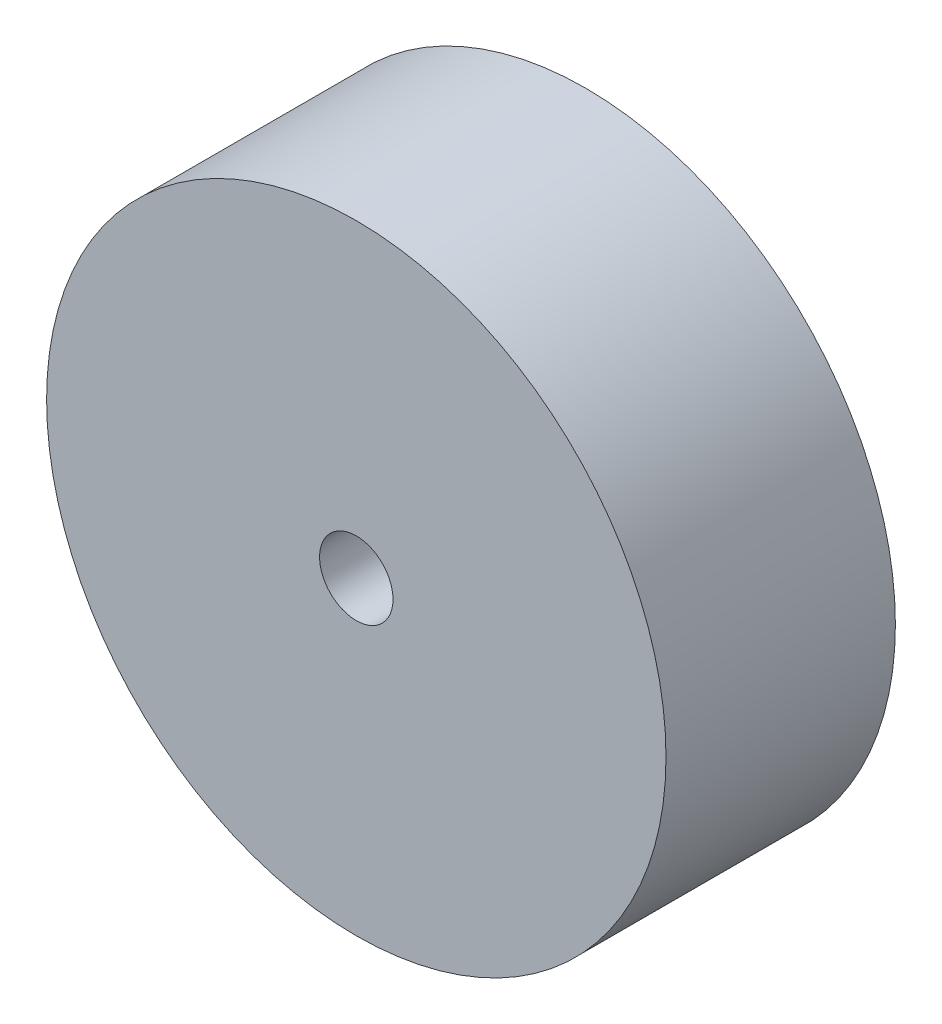
ISO-10303-21;
HEADER;
FILE_DESCRIPTION(('STEP AP214'),'2;1');
FILE_NAME('part.step','',(''),(''),'','','');
FILE_SCHEMA(('AUTOMOTIVE_DESIGN { 1 0 10303 214 1 1 1 1 }'));
ENDSEC;
DATA;
#1=APPLICATION_CONTEXT('core data for automotive mechanical design processes');
#2=APPLICATION_PROTOCOL_DEFINITION('international standard','automotive_design',2000,#1);
#3=PRODUCT_CONTEXT('',#1,'mechanical');
#4=PRODUCT('Part','Part','',(#3));
#5=PRODUCT_RELATED_PRODUCT_CATEGORY('part','',(#4));
#6=PRODUCT_DEFINITION_FORMATION('','',#4);
#7=PRODUCT_DEFINITION_CONTEXT('part definition',#1,'design');
#8=PRODUCT_DEFINITION('design','',#6,#7);
#9=PRODUCT_DEFINITION_SHAPE('','',#8);
#10=(LENGTH_UNIT() NAMED_UNIT(*) SI_UNIT(.MILLI.,.METRE.));
#11=(NAMED_UNIT(*) PLANE_ANGLE_UNIT() SI_UNIT($,.RADIAN.));
#12=(NAMED_UNIT(*) SI_UNIT($,.STERADIAN.) SOLID_ANGLE_UNIT());
#13=UNCERTAINTY_MEASURE_WITH_UNIT(LENGTH_MEASURE(1.E-05),#10,'distance_accuracy_value','');
#14=(GEOMETRIC_REPRESENTATION_CONTEXT(3) GLOBAL_UNCERTAINTY_ASSIGNED_CONTEXT((#13)) GLOBAL_UNIT_ASSIGNED_CONTEXT((#10,
#11,#12)) REPRESENTATION_CONTEXT('',''));
#15=CARTESIAN_POINT('',(0.,0.,0.));
#16=DIRECTION('',(0.,0.,1.));
#17=DIRECTION('',(1.,0.,0.));
#18=AXIS2_PLACEMENT_3D('',#15,#16,#17);
#19=CARTESIAN_POINT('',(0.,0.,50.));
#20=DIRECTION('',(0.,0.,1.));
#21=DIRECTION('',(1.,0.,0.));
#22=AXIS2_PLACEMENT_3D('',#19,#20,#21);
#23=PLANE('',#22);
#24=CARTESIAN_POINT('',(0.,0.,50.));
#25=DIRECTION('',(0.,0.,1.));
#26=DIRECTION('',(1.,0.,0.));
#27=AXIS2_PLACEMENT_3D('',#24,#25,#26);
#28=CIRCLE('',#27,67.5);
#29=CARTESIAN_POINT('',(67.5,0.,50.));
#30=VERTEX_POINT('',#29);
#31=EDGE_CURVE('E10',#30,#30,#28,.T.);
#32=ORIENTED_EDGE('',*,*,#31,.T.);
#33=EDGE_LOOP('',(#32));
#34=FACE_BOUND('',#33,.T.);
#35=CARTESIAN_POINT('',(0.,0.,50.));
#36=DIRECTION('',(0.,0.,1.));
#37=DIRECTION('',(1.,0.,0.));
#38=AXIS2_PLACEMENT_3D('',#35,#36,#37);
#39=CIRCLE('',#38,8.);
#40=CARTESIAN_POINT('',(8.,0.,50.));
#41=VERTEX_POINT('',#40);
#42=EDGE_CURVE('E43',#41,#41,#39,.T.);
#43=ORIENTED_EDGE('',*,*,#42,.F.);
#44=EDGE_LOOP('',(#43));
#45=FACE_BOUND('',#44,.T.);
#46=ADVANCED_FACE('F32',(#34,#45),#23,.T.);
#47=CARTESIAN_POINT('',(0.,0.,0.));
#48=DIRECTION('',(0.,0.,1.));
#49=DIRECTION('',(1.,0.,0.));
#50=AXIS2_PLACEMENT_3D('',#47,#48,#49);
#51=PLANE('',#50);
#52=CARTESIAN_POINT('',(0.,0.,0.));
#53=DIRECTION('',(0.,0.,1.));
#54=DIRECTION('',(1.,0.,0.));
#55=AXIS2_PLACEMENT_3D('',#52,#53,#54);
#56=CIRCLE('',#55,67.5);
#57=CARTESIAN_POINT('',(67.5,0.,0.));
#58=VERTEX_POINT('',#57);
#59=EDGE_CURVE('E36',#58,#58,#56,.T.);
#60=ORIENTED_EDGE('',*,*,#59,.F.);
#61=EDGE_LOOP('',(#60));
#62=FACE_BOUND('',#61,.T.);
#63=CARTESIAN_POINT('',(0.,0.,0.));
#64=DIRECTION('',(0.,0.,1.));
#65=DIRECTION('',(1.,0.,0.));
#66=AXIS2_PLACEMENT_3D('',#63,#64,#65);
#67=CIRCLE('',#66,8.);
#68=CARTESIAN_POINT('',(8.,0.,0.));
#69=VERTEX_POINT('',#68);
#70=EDGE_CURVE('E45',#69,#69,#67,.T.);
#71=ORIENTED_EDGE('',*,*,#70,.T.);
#72=EDGE_LOOP('',(#71));
#73=FACE_BOUND('',#72,.T.);
#74=ADVANCED_FACE('F55',(#62,#73),#51,.F.);
#75=CARTESIAN_POINT('',(0.,0.,50.));
#76=DIRECTION('',(0.,0.,-1.));
#77=DIRECTION('',(-1.,0.,0.));
#78=AXIS2_PLACEMENT_3D('',#75,#76,#77);
#79=CYLINDRICAL_SURFACE('',#78,67.5);
#80=ORIENTED_EDGE('',*,*,#31,.F.);
#81=EDGE_LOOP('',(#80));
#82=FACE_BOUND('',#81,.T.);
#83=ORIENTED_EDGE('',*,*,#59,.T.);
#84=EDGE_LOOP('',(#83));
#85=FACE_BOUND('',#84,.T.);
#86=ADVANCED_FACE('F34',(#82,#85),#79,.T.);
#87=CARTESIAN_POINT('',(0.,0.,50.));
#88=DIRECTION('',(0.,0.,-1.));
#89=DIRECTION('',(-1.,0.,0.));
#90=AXIS2_PLACEMENT_3D('',#87,#88,#89);
#91=CYLINDRICAL_SURFACE('',#90,8.);
#92=ORIENTED_EDGE('',*,*,#42,.T.);
#93=EDGE_LOOP('',(#92));
#94=FACE_BOUND('',#93,.T.);
#95=ORIENTED_EDGE('',*,*,#70,.F.);
#96=EDGE_LOOP('',(#95));
#97=FACE_BOUND('',#96,.T.);
#98=ADVANCED_FACE('F51',(#94,#97),#91,.F.);
#99=CLOSED_SHELL('',(#46,#74,#86,#98));
#100=MANIFOLD_SOLID_BREP('B2',#99);
#101=ADVANCED_BREP_SHAPE_REPRESENTATION('',(#18,#100),#14);
#102=SHAPE_DEFINITION_REPRESENTATION(#9,#101);
ENDSEC;
END-ISO-10303-21;
